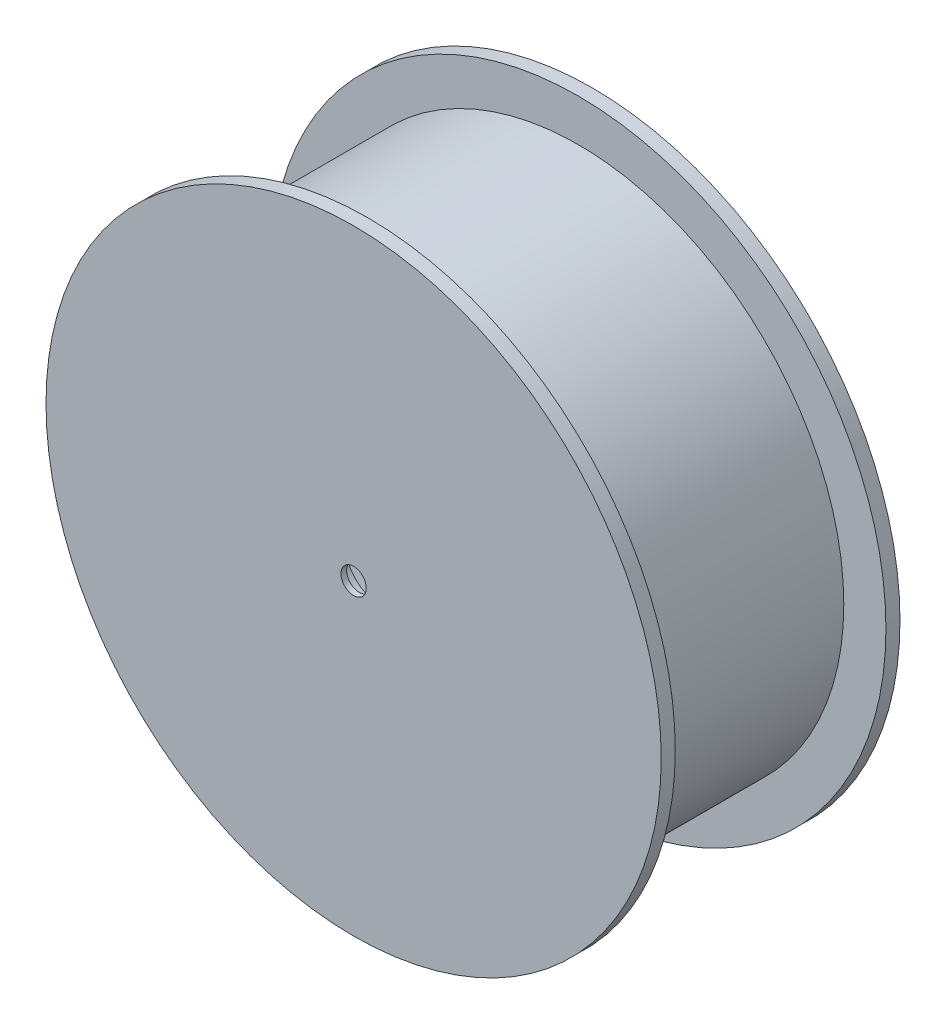
ISO-10303-21;
HEADER;
FILE_DESCRIPTION(('STEP AP214'),'2;1');
FILE_NAME('part.step','',(''),(''),'','','');
FILE_SCHEMA(('AUTOMOTIVE_DESIGN { 1 0 10303 214 1 1 1 1 }'));
ENDSEC;
DATA;
#1=APPLICATION_CONTEXT('core data for automotive mechanical design processes');
#2=APPLICATION_PROTOCOL_DEFINITION('international standard','automotive_design',2000,#1);
#3=PRODUCT_CONTEXT('',#1,'mechanical');
#4=PRODUCT('Part','Part','',(#3));
#5=PRODUCT_RELATED_PRODUCT_CATEGORY('part','',(#4));
#6=PRODUCT_DEFINITION_FORMATION('','',#4);
#7=PRODUCT_DEFINITION_CONTEXT('part definition',#1,'design');
#8=PRODUCT_DEFINITION('design','',#6,#7);
#9=PRODUCT_DEFINITION_SHAPE('','',#8);
#10=(LENGTH_UNIT() NAMED_UNIT(*) SI_UNIT(.MILLI.,.METRE.));
#11=(NAMED_UNIT(*) PLANE_ANGLE_UNIT() SI_UNIT($,.RADIAN.));
#12=(NAMED_UNIT(*) SI_UNIT($,.STERADIAN.) SOLID_ANGLE_UNIT());
#13=UNCERTAINTY_MEASURE_WITH_UNIT(LENGTH_MEASURE(1.E-05),#10,'distance_accuracy_value','');
#14=(GEOMETRIC_REPRESENTATION_CONTEXT(3) GLOBAL_UNCERTAINTY_ASSIGNED_CONTEXT((#13)) GLOBAL_UNIT_ASSIGNED_CONTEXT((#10,
#11,#12)) REPRESENTATION_CONTEXT('',''));
#15=CARTESIAN_POINT('',(0.,0.,0.));
#16=DIRECTION('',(0.,0.,1.));
#17=DIRECTION('',(1.,0.,0.));
#18=AXIS2_PLACEMENT_3D('',#15,#16,#17);
#19=CARTESIAN_POINT('',(0.,0.,-60.5882352941176));
#20=DIRECTION('',(0.,0.,1.));
#21=DIRECTION('',(1.,0.,0.));
#22=AXIS2_PLACEMENT_3D('',#19,#20,#21);
#23=CYLINDRICAL_SURFACE('',#22,4.5);
#24=CARTESIAN_POINT('',(0.,0.,24.4117647058824));
#25=DIRECTION('',(0.,0.,1.));
#26=DIRECTION('',(1.,0.,0.));
#27=AXIS2_PLACEMENT_3D('',#24,#25,#26);
#28=CIRCLE('',#27,4.5);
#29=CARTESIAN_POINT('',(4.5,0.,24.4117647058824));
#30=VERTEX_POINT('',#29);
#31=EDGE_CURVE('E215',#30,#30,#28,.T.);
#32=ORIENTED_EDGE('',*,*,#31,.T.);
#33=EDGE_LOOP('',(#32));
#34=FACE_BOUND('',#33,.T.);
#35=CARTESIAN_POINT('',(0.,0.,22.4117647058824));
#36=DIRECTION('',(0.,0.,-1.));
#37=DIRECTION('',(-1.,0.,0.));
#38=AXIS2_PLACEMENT_3D('',#35,#36,#37);
#39=CIRCLE('',#38,4.5);
#40=CARTESIAN_POINT('',(-4.5,0.,22.4117647058824));
#41=VERTEX_POINT('',#40);
#42=EDGE_CURVE('E37',#41,#41,#39,.F.);
#43=ORIENTED_EDGE('',*,*,#42,.F.);
#44=EDGE_LOOP('',(#43));
#45=FACE_BOUND('',#44,.T.);
#46=ADVANCED_FACE('F33',(#34,#45),#23,.F.);
#47=CARTESIAN_POINT('',(0.,0.,14.4117647058824));
#48=DIRECTION('',(0.,0.,-1.));
#49=DIRECTION('',(-1.,0.,0.));
#50=AXIS2_PLACEMENT_3D('',#47,#48,#49);
#51=PLANE('',#50);
#52=CARTESIAN_POINT('',(0.,0.,14.4117647058824));
#53=DIRECTION('',(0.,0.,-1.));
#54=DIRECTION('',(-1.,0.,0.));
#55=AXIS2_PLACEMENT_3D('',#52,#53,#54);
#56=CIRCLE('',#55,13.);
#57=CARTESIAN_POINT('',(-13.,0.,14.4117647058824));
#58=VERTEX_POINT('',#57);
#59=EDGE_CURVE('E208',#58,#58,#56,.T.);
#60=ORIENTED_EDGE('',*,*,#59,.F.);
#61=EDGE_LOOP('',(#60));
#62=FACE_BOUND('',#61,.T.);
#63=CARTESIAN_POINT('',(0.,0.,14.4117647058824));
#64=DIRECTION('',(0.,0.,1.));
#65=DIRECTION('',(1.,0.,0.));
#66=AXIS2_PLACEMENT_3D('',#63,#64,#65);
#67=CIRCLE('',#66,84.5);
#68=CARTESIAN_POINT('',(84.5,0.,14.4117647058824));
#69=VERTEX_POINT('',#68);
#70=EDGE_CURVE('E11',#69,#69,#67,.T.);
#71=ORIENTED_EDGE('',*,*,#70,.F.);
#72=EDGE_LOOP('',(#71));
#73=FACE_BOUND('',#72,.T.);
#74=ADVANCED_FACE('F35',(#62,#73),#51,.T.);
#75=CARTESIAN_POINT('',(0.,0.,33.8970588235295));
#76=DIRECTION('',(0.,0.,1.));
#77=DIRECTION('',(1.,0.,0.));
#78=AXIS2_PLACEMENT_3D('',#75,#76,#77);
#79=CYLINDRICAL_SURFACE('',#78,84.5);
#80=DIRECTION('',(0.,0.,-1.));
#81=VECTOR('',#80,1.);
#82=CARTESIAN_POINT('',(-78.426086848689,31.4578909274271,-57.5882352941176));
#83=LINE('',#82,#81);
#84=CARTESIAN_POINT('',(-78.426086848689,31.4578909274271,-57.5882352941176));
#85=VERTEX_POINT('',#84);
#86=CARTESIAN_POINT('',(-78.4260868486889,31.4578909274271,-60.5882352941176));
#87=VERTEX_POINT('',#86);
#88=EDGE_CURVE('E136',#85,#87,#83,.T.);
#89=ORIENTED_EDGE('',*,*,#88,.F.);
#90=CARTESIAN_POINT('',(0.,0.,-57.5882352941176));
#91=DIRECTION('',(0.,0.,1.));
#92=DIRECTION('',(-1.,0.,0.));
#93=AXIS2_PLACEMENT_3D('',#90,#91,#92);
#94=CIRCLE('',#93,84.5);
#95=CARTESIAN_POINT('',(-66.4563761169763,52.1900380666558,-57.5882352941176));
#96=VERTEX_POINT('',#95);
#97=EDGE_CURVE('E125',#96,#85,#94,.T.);
#98=ORIENTED_EDGE('',*,*,#97,.F.);
#99=DIRECTION('',(0.,0.,-1.));
#100=VECTOR('',#99,1.);
#101=CARTESIAN_POINT('',(-66.4563761169763,52.1900380666558,-57.5882352941176));
#102=LINE('',#101,#100);
#103=CARTESIAN_POINT('',(-66.4563761169763,52.1900380666558,-60.5882352941176));
#104=VERTEX_POINT('',#103);
#105=EDGE_CURVE('E138',#96,#104,#102,.T.);
#106=ORIENTED_EDGE('',*,*,#105,.T.);
#107=CARTESIAN_POINT('',(0.,0.,-60.5882352941176));
#108=DIRECTION('',(0.,0.,1.));
#109=DIRECTION('',(1.,0.,0.));
#110=AXIS2_PLACEMENT_3D('',#107,#108,#109);
#111=CIRCLE('',#110,84.5);
#112=CARTESIAN_POINT('',(-11.9697107317126,83.6479289940828,-60.5882352941176));
#113=VERTEX_POINT('',#112);
#114=EDGE_CURVE('E42',#113,#104,#111,.T.);
#115=ORIENTED_EDGE('',*,*,#114,.F.);
#116=DIRECTION('',(0.,0.,-1.));
#117=VECTOR('',#116,1.);
#118=CARTESIAN_POINT('',(-11.9697107317126,83.6479289940829,-57.5882352941176));
#119=LINE('',#118,#117);
#120=CARTESIAN_POINT('',(-11.9697107317126,83.6479289940829,-57.5882352941176));
#121=VERTEX_POINT('',#120);
#122=EDGE_CURVE('E202',#121,#113,#119,.T.);
#123=ORIENTED_EDGE('',*,*,#122,.F.);
#124=CARTESIAN_POINT('',(0.,0.,-57.5882352941176));
#125=DIRECTION('',(0.,0.,1.));
#126=DIRECTION('',(-1.,0.,0.));
#127=AXIS2_PLACEMENT_3D('',#124,#125,#126);
#128=CIRCLE('',#127,84.5);
#129=CARTESIAN_POINT('',(11.9697107317126,83.6479289940829,-57.5882352941176));
#130=VERTEX_POINT('',#129);
#131=EDGE_CURVE('E197',#130,#121,#128,.T.);
#132=ORIENTED_EDGE('',*,*,#131,.F.);
#133=DIRECTION('',(0.,0.,-1.));
#134=VECTOR('',#133,1.);
#135=CARTESIAN_POINT('',(11.9697107317126,83.6479289940829,-57.5882352941176));
#136=LINE('',#135,#134);
#137=CARTESIAN_POINT('',(11.9697107317126,83.6479289940829,-60.5882352941176));
#138=VERTEX_POINT('',#137);
#139=EDGE_CURVE('E205',#130,#138,#136,.T.);
#140=ORIENTED_EDGE('',*,*,#139,.T.);
#141=CARTESIAN_POINT('',(66.4563761169763,52.1900380666558,-60.5882352941176));
#142=VERTEX_POINT('',#141);
#143=EDGE_CURVE('E236',#142,#138,#111,.T.);
#144=ORIENTED_EDGE('',*,*,#143,.F.);
#145=DIRECTION('',(0.,0.,-1.));
#146=VECTOR('',#145,1.);
#147=CARTESIAN_POINT('',(66.4563761169764,52.1900380666558,-57.5882352941176));
#148=LINE('',#147,#146);
#149=CARTESIAN_POINT('',(66.4563761169764,52.1900380666558,-57.5882352941176));
#150=VERTEX_POINT('',#149);
#151=EDGE_CURVE('E49',#150,#142,#148,.T.);
#152=ORIENTED_EDGE('',*,*,#151,.F.);
#153=CARTESIAN_POINT('',(0.,0.,-57.5882352941176));
#154=DIRECTION('',(0.,0.,1.));
#155=DIRECTION('',(-1.,0.,0.));
#156=AXIS2_PLACEMENT_3D('',#153,#154,#155);
#157=CIRCLE('',#156,84.5);
#158=CARTESIAN_POINT('',(78.426086848689,31.4578909274271,-57.5882352941176));
#159=VERTEX_POINT('',#158);
#160=EDGE_CURVE('E186',#159,#150,#157,.T.);
#161=ORIENTED_EDGE('',*,*,#160,.F.);
#162=DIRECTION('',(0.,0.,-1.));
#163=VECTOR('',#162,1.);
#164=CARTESIAN_POINT('',(78.426086848689,31.4578909274271,-57.5882352941176));
#165=LINE('',#164,#163);
#166=CARTESIAN_POINT('',(78.426086848689,31.4578909274271,-60.5882352941176));
#167=VERTEX_POINT('',#166);
#168=EDGE_CURVE('E182',#159,#167,#165,.T.);
#169=ORIENTED_EDGE('',*,*,#168,.T.);
#170=CARTESIAN_POINT('',(78.4260868486889,-31.4578909274272,-60.5882352941176));
#171=VERTEX_POINT('',#170);
#172=EDGE_CURVE('E242',#171,#167,#111,.T.);
#173=ORIENTED_EDGE('',*,*,#172,.F.);
#174=DIRECTION('',(0.,0.,-1.));
#175=VECTOR('',#174,1.);
#176=CARTESIAN_POINT('',(78.426086848689,-31.4578909274272,-57.5882352941176));
#177=LINE('',#176,#175);
#178=CARTESIAN_POINT('',(78.426086848689,-31.4578909274272,-57.5882352941176));
#179=VERTEX_POINT('',#178);
#180=EDGE_CURVE('E57',#179,#171,#177,.T.);
#181=ORIENTED_EDGE('',*,*,#180,.F.);
#182=CARTESIAN_POINT('',(0.,0.,-57.5882352941176));
#183=DIRECTION('',(0.,0.,1.));
#184=DIRECTION('',(-1.,0.,0.));
#185=AXIS2_PLACEMENT_3D('',#182,#183,#184);
#186=CIRCLE('',#185,84.5);
#187=CARTESIAN_POINT('',(66.4563761169764,-52.1900380666558,-57.5882352941176));
#188=VERTEX_POINT('',#187);
#189=EDGE_CURVE('E175',#188,#179,#186,.T.);
#190=ORIENTED_EDGE('',*,*,#189,.F.);
#191=DIRECTION('',(0.,0.,-1.));
#192=VECTOR('',#191,1.);
#193=CARTESIAN_POINT('',(66.4563761169764,-52.1900380666558,-57.5882352941176));
#194=LINE('',#193,#192);
#195=CARTESIAN_POINT('',(66.4563761169764,-52.1900380666558,-60.5882352941176));
#196=VERTEX_POINT('',#195);
#197=EDGE_CURVE('E171',#188,#196,#194,.T.);
#198=ORIENTED_EDGE('',*,*,#197,.T.);
#199=CARTESIAN_POINT('',(11.9697107317126,-83.6479289940828,-60.5882352941176));
#200=VERTEX_POINT('',#199);
#201=EDGE_CURVE('E245',#200,#196,#111,.T.);
#202=ORIENTED_EDGE('',*,*,#201,.F.);
#203=DIRECTION('',(0.,0.,-1.));
#204=VECTOR('',#203,1.);
#205=CARTESIAN_POINT('',(11.9697107317126,-83.6479289940829,-57.5882352941176));
#206=LINE('',#205,#204);
#207=CARTESIAN_POINT('',(11.9697107317126,-83.6479289940829,-57.5882352941176));
#208=VERTEX_POINT('',#207);
#209=EDGE_CURVE('E169',#208,#200,#206,.T.);
#210=ORIENTED_EDGE('',*,*,#209,.F.);
#211=CARTESIAN_POINT('',(0.,0.,-57.5882352941176));
#212=DIRECTION('',(0.,0.,1.));
#213=DIRECTION('',(-1.,0.,0.));
#214=AXIS2_PLACEMENT_3D('',#211,#212,#213);
#215=CIRCLE('',#214,84.5);
#216=CARTESIAN_POINT('',(-11.9697107317126,-83.6479289940829,-57.5882352941176));
#217=VERTEX_POINT('',#216);
#218=EDGE_CURVE('E163',#217,#208,#215,.T.);
#219=ORIENTED_EDGE('',*,*,#218,.F.);
#220=DIRECTION('',(0.,0.,-1.));
#221=VECTOR('',#220,1.);
#222=CARTESIAN_POINT('',(-11.9697107317126,-83.6479289940829,-57.5882352941176));
#223=LINE('',#222,#221);
#224=CARTESIAN_POINT('',(-11.9697107317126,-83.6479289940829,-60.5882352941176));
#225=VERTEX_POINT('',#224);
#226=EDGE_CURVE('E159',#217,#225,#223,.T.);
#227=ORIENTED_EDGE('',*,*,#226,.T.);
#228=CARTESIAN_POINT('',(-66.4563761169763,-52.1900380666558,-60.5882352941176));
#229=VERTEX_POINT('',#228);
#230=EDGE_CURVE('E241',#229,#225,#111,.T.);
#231=ORIENTED_EDGE('',*,*,#230,.F.);
#232=DIRECTION('',(0.,0.,-1.));
#233=VECTOR('',#232,1.);
#234=CARTESIAN_POINT('',(-66.4563761169764,-52.1900380666558,-57.5882352941176));
#235=LINE('',#234,#233);
#236=CARTESIAN_POINT('',(-66.4563761169764,-52.1900380666558,-57.5882352941176));
#237=VERTEX_POINT('',#236);
#238=EDGE_CURVE('E157',#237,#229,#235,.T.);
#239=ORIENTED_EDGE('',*,*,#238,.F.);
#240=CARTESIAN_POINT('',(0.,0.,-57.5882352941176));
#241=DIRECTION('',(0.,0.,1.));
#242=DIRECTION('',(-1.,0.,0.));
#243=AXIS2_PLACEMENT_3D('',#240,#241,#242);
#244=CIRCLE('',#243,84.5);
#245=CARTESIAN_POINT('',(-78.426086848689,-31.4578909274271,-57.5882352941176));
#246=VERTEX_POINT('',#245);
#247=EDGE_CURVE('E151',#246,#237,#244,.T.);
#248=ORIENTED_EDGE('',*,*,#247,.F.);
#249=DIRECTION('',(0.,0.,-1.));
#250=VECTOR('',#249,1.);
#251=CARTESIAN_POINT('',(-78.426086848689,-31.4578909274271,-57.5882352941176));
#252=LINE('',#251,#250);
#253=CARTESIAN_POINT('',(-78.426086848689,-31.4578909274271,-60.5882352941176));
#254=VERTEX_POINT('',#253);
#255=EDGE_CURVE('E160',#246,#254,#252,.T.);
#256=ORIENTED_EDGE('',*,*,#255,.T.);
#257=EDGE_CURVE('E145',#87,#254,#111,.T.);
#258=ORIENTED_EDGE('',*,*,#257,.F.);
#259=EDGE_LOOP('',(#89,#98,#106,#115,#123,#132,#140,#144,#152,#161,#169,#173,#181,#190,#198,
#202,#210,#219,#227,#231,#239,#248,#256,#258));
#260=FACE_BOUND('',#259,.T.);
#261=ORIENTED_EDGE('',*,*,#70,.T.);
#262=EDGE_LOOP('',(#261));
#263=FACE_BOUND('',#262,.T.);
#264=ADVANCED_FACE('F141',(#260,#263),#79,.F.);
#265=CARTESIAN_POINT('',(0.,-84.5,-60.5882352941176));
#266=DIRECTION('',(0.,0.,-1.));
#267=DIRECTION('',(-1.,0.,0.));
#268=AXIS2_PLACEMENT_3D('',#265,#266,#267);
#269=PLANE('',#268);
#270=CARTESIAN_POINT('',(-73.1791466197851,42.25,-60.5882352941176));
#271=DIRECTION('',(0.,0.,-1.));
#272=DIRECTION('',(-1.,0.,0.));
#273=AXIS2_PLACEMENT_3D('',#270,#271,#272);
#274=CIRCLE('',#273,12.);
#275=EDGE_CURVE('E132',#87,#104,#274,.T.);
#276=ORIENTED_EDGE('',*,*,#275,.F.);
#277=ORIENTED_EDGE('',*,*,#257,.T.);
#278=CARTESIAN_POINT('',(-73.1791466197851,-42.25,-60.5882352941176));
#279=DIRECTION('',(0.,0.,-1.));
#280=DIRECTION('',(-1.,0.,0.));
#281=AXIS2_PLACEMENT_3D('',#278,#279,#280);
#282=CIRCLE('',#281,12.);
#283=EDGE_CURVE('E154',#229,#254,#282,.T.);
#284=ORIENTED_EDGE('',*,*,#283,.F.);
#285=ORIENTED_EDGE('',*,*,#230,.T.);
#286=CARTESIAN_POINT('',(0.,-84.5,-60.5882352941176));
#287=DIRECTION('',(0.,0.,-1.));
#288=DIRECTION('',(-1.,0.,0.));
#289=AXIS2_PLACEMENT_3D('',#286,#287,#288);
#290=CIRCLE('',#289,12.);
#291=EDGE_CURVE('E166',#200,#225,#290,.T.);
#292=ORIENTED_EDGE('',*,*,#291,.F.);
#293=ORIENTED_EDGE('',*,*,#201,.T.);
#294=CARTESIAN_POINT('',(73.179146619785,-42.2500000000001,-60.5882352941176));
#295=DIRECTION('',(0.,0.,-1.));
#296=DIRECTION('',(-1.,0.,0.));
#297=AXIS2_PLACEMENT_3D('',#294,#295,#296);
#298=CIRCLE('',#297,12.);
#299=EDGE_CURVE('E178',#171,#196,#298,.T.);
#300=ORIENTED_EDGE('',*,*,#299,.F.);
#301=ORIENTED_EDGE('',*,*,#172,.T.);
#302=CARTESIAN_POINT('',(73.1791466197851,42.25,-60.5882352941176));
#303=DIRECTION('',(0.,0.,-1.));
#304=DIRECTION('',(-1.,0.,0.));
#305=AXIS2_PLACEMENT_3D('',#302,#303,#304);
#306=CIRCLE('',#305,12.);
#307=EDGE_CURVE('E189',#142,#167,#306,.T.);
#308=ORIENTED_EDGE('',*,*,#307,.F.);
#309=ORIENTED_EDGE('',*,*,#143,.T.);
#310=CARTESIAN_POINT('',(0.,84.5,-60.5882352941176));
#311=DIRECTION('',(0.,0.,-1.));
#312=DIRECTION('',(-1.,0.,0.));
#313=AXIS2_PLACEMENT_3D('',#310,#311,#312);
#314=CIRCLE('',#313,12.);
#315=EDGE_CURVE('E147',#113,#138,#314,.T.);
#316=ORIENTED_EDGE('',*,*,#315,.F.);
#317=ORIENTED_EDGE('',*,*,#114,.T.);
#318=EDGE_LOOP('',(#276,#277,#284,#285,#292,#293,#300,#301,#308,#309,#316,#317));
#319=FACE_BOUND('',#318,.T.);
#320=CARTESIAN_POINT('',(0.,0.,-60.5882352941176));
#321=DIRECTION('',(0.,0.,1.));
#322=DIRECTION('',(1.,0.,0.));
#323=AXIS2_PLACEMENT_3D('',#320,#321,#322);
#324=CIRCLE('',#323,109.5);
#325=CARTESIAN_POINT('',(109.5,0.,-60.5882352941176));
#326=VERTEX_POINT('',#325);
#327=EDGE_CURVE('E233',#326,#326,#324,.T.);
#328=ORIENTED_EDGE('',*,*,#327,.F.);
#329=EDGE_LOOP('',(#328));
#330=FACE_BOUND('',#329,.T.);
#331=ADVANCED_FACE('F253',(#319,#330),#269,.T.);
#332=CARTESIAN_POINT('',(0.,0.,33.8970588235295));
#333=DIRECTION('',(0.,0.,1.));
#334=DIRECTION('',(1.,0.,0.));
#335=AXIS2_PLACEMENT_3D('',#332,#333,#334);
#336=CYLINDRICAL_SURFACE('',#335,109.5);
#337=ORIENTED_EDGE('',*,*,#327,.T.);
#338=EDGE_LOOP('',(#337));
#339=FACE_BOUND('',#338,.T.);
#340=CARTESIAN_POINT('',(0.,0.,-55.5882352941176));
#341=DIRECTION('',(0.,0.,1.));
#342=DIRECTION('',(1.,0.,0.));
#343=AXIS2_PLACEMENT_3D('',#340,#341,#342);
#344=CIRCLE('',#343,109.5);
#345=CARTESIAN_POINT('',(109.5,0.,-55.5882352941176));
#346=VERTEX_POINT('',#345);
#347=EDGE_CURVE('E230',#346,#346,#344,.T.);
#348=ORIENTED_EDGE('',*,*,#347,.F.);
#349=EDGE_LOOP('',(#348));
#350=FACE_BOUND('',#349,.T.);
#351=ADVANCED_FACE('F310',(#339,#350),#336,.T.);
#352=CARTESIAN_POINT('',(0.,-94.5,-55.5882352941176));
#353=DIRECTION('',(0.,0.,1.));
#354=DIRECTION('',(1.,0.,0.));
#355=AXIS2_PLACEMENT_3D('',#352,#353,#354);
#356=PLANE('',#355);
#357=ORIENTED_EDGE('',*,*,#347,.T.);
#358=EDGE_LOOP('',(#357));
#359=FACE_BOUND('',#358,.T.);
#360=CARTESIAN_POINT('',(0.,0.,-55.5882352941176));
#361=DIRECTION('',(0.,0.,1.));
#362=DIRECTION('',(1.,0.,0.));
#363=AXIS2_PLACEMENT_3D('',#360,#361,#362);
#364=CIRCLE('',#363,94.5);
#365=CARTESIAN_POINT('',(94.5,0.,-55.5882352941176));
#366=VERTEX_POINT('',#365);
#367=EDGE_CURVE('E227',#366,#366,#364,.T.);
#368=ORIENTED_EDGE('',*,*,#367,.F.);
#369=EDGE_LOOP('',(#368));
#370=FACE_BOUND('',#369,.T.);
#371=ADVANCED_FACE('F306',(#359,#370),#356,.T.);
#372=CARTESIAN_POINT('',(0.,0.,33.8970588235295));
#373=DIRECTION('',(0.,0.,1.));
#374=DIRECTION('',(1.,0.,0.));
#375=AXIS2_PLACEMENT_3D('',#372,#373,#374);
#376=CYLINDRICAL_SURFACE('',#375,94.5);
#377=ORIENTED_EDGE('',*,*,#367,.T.);
#378=EDGE_LOOP('',(#377));
#379=FACE_BOUND('',#378,.T.);
#380=CARTESIAN_POINT('',(0.,0.,19.4117647058824));
#381=DIRECTION('',(0.,0.,1.));
#382=DIRECTION('',(1.,0.,0.));
#383=AXIS2_PLACEMENT_3D('',#380,#381,#382);
#384=CIRCLE('',#383,94.5);
#385=CARTESIAN_POINT('',(94.5,0.,19.4117647058824));
#386=VERTEX_POINT('',#385);
#387=EDGE_CURVE('E224',#386,#386,#384,.T.);
#388=ORIENTED_EDGE('',*,*,#387,.F.);
#389=EDGE_LOOP('',(#388));
#390=FACE_BOUND('',#389,.T.);
#391=ADVANCED_FACE('F302',(#379,#390),#376,.T.);
#392=CARTESIAN_POINT('',(0.,-109.5,19.4117647058824));
#393=DIRECTION('',(0.,0.,-1.));
#394=DIRECTION('',(-1.,0.,0.));
#395=AXIS2_PLACEMENT_3D('',#392,#393,#394);
#396=PLANE('',#395);
#397=ORIENTED_EDGE('',*,*,#387,.T.);
#398=EDGE_LOOP('',(#397));
#399=FACE_BOUND('',#398,.T.);
#400=CARTESIAN_POINT('',(0.,0.,19.4117647058824));
#401=DIRECTION('',(0.,0.,1.));
#402=DIRECTION('',(1.,0.,0.));
#403=AXIS2_PLACEMENT_3D('',#400,#401,#402);
#404=CIRCLE('',#403,109.5);
#405=CARTESIAN_POINT('',(109.5,0.,19.4117647058824));
#406=VERTEX_POINT('',#405);
#407=EDGE_CURVE('E221',#406,#406,#404,.T.);
#408=ORIENTED_EDGE('',*,*,#407,.F.);
#409=EDGE_LOOP('',(#408));
#410=FACE_BOUND('',#409,.T.);
#411=ADVANCED_FACE('F298',(#399,#410),#396,.T.);
#412=CARTESIAN_POINT('',(0.,0.,33.8970588235295));
#413=DIRECTION('',(0.,0.,1.));
#414=DIRECTION('',(1.,0.,0.));
#415=AXIS2_PLACEMENT_3D('',#412,#413,#414);
#416=CYLINDRICAL_SURFACE('',#415,109.5);
#417=ORIENTED_EDGE('',*,*,#407,.T.);
#418=EDGE_LOOP('',(#417));
#419=FACE_BOUND('',#418,.T.);
#420=CARTESIAN_POINT('',(0.,0.,24.4117647058824));
#421=DIRECTION('',(0.,0.,1.));
#422=DIRECTION('',(1.,0.,0.));
#423=AXIS2_PLACEMENT_3D('',#420,#421,#422);
#424=CIRCLE('',#423,109.5);
#425=CARTESIAN_POINT('',(109.5,0.,24.4117647058824));
#426=VERTEX_POINT('',#425);
#427=EDGE_CURVE('E218',#426,#426,#424,.T.);
#428=ORIENTED_EDGE('',*,*,#427,.F.);
#429=EDGE_LOOP('',(#428));
#430=FACE_BOUND('',#429,.T.);
#431=ADVANCED_FACE('F294',(#419,#430),#416,.T.);
#432=CARTESIAN_POINT('',(0.,0.,24.4117647058824));
#433=DIRECTION('',(0.,0.,1.));
#434=DIRECTION('',(1.,0.,0.));
#435=AXIS2_PLACEMENT_3D('',#432,#433,#434);
#436=PLANE('',#435);
#437=ORIENTED_EDGE('',*,*,#31,.F.);
#438=EDGE_LOOP('',(#437));
#439=FACE_BOUND('',#438,.T.);
#440=ORIENTED_EDGE('',*,*,#427,.T.);
#441=EDGE_LOOP('',(#440));
#442=FACE_BOUND('',#441,.T.);
#443=ADVANCED_FACE('F290',(#439,#442),#436,.T.);
#444=CARTESIAN_POINT('',(0.,0.,22.4117647058824));
#445=DIRECTION('',(0.,0.,-1.));
#446=DIRECTION('',(-1.,0.,0.));
#447=AXIS2_PLACEMENT_3D('',#444,#445,#446);
#448=PLANE('',#447);
#449=CARTESIAN_POINT('',(0.,0.,22.4117647058824));
#450=DIRECTION('',(0.,0.,-1.));
#451=DIRECTION('',(-1.,0.,0.));
#452=AXIS2_PLACEMENT_3D('',#449,#450,#451);
#453=CIRCLE('',#452,13.);
#454=CARTESIAN_POINT('',(-13.,0.,22.4117647058824));
#455=VERTEX_POINT('',#454);
#456=EDGE_CURVE('E210',#455,#455,#453,.T.);
#457=ORIENTED_EDGE('',*,*,#456,.T.);
#458=EDGE_LOOP('',(#457));
#459=FACE_BOUND('',#458,.T.);
#460=ORIENTED_EDGE('',*,*,#42,.T.);
#461=EDGE_LOOP('',(#460));
#462=FACE_BOUND('',#461,.T.);
#463=ADVANCED_FACE('F293',(#459,#462),#448,.T.);
#464=CARTESIAN_POINT('',(0.,0.,22.4117647058824));
#465=DIRECTION('',(0.,0.,-1.));
#466=DIRECTION('',(-1.,0.,0.));
#467=AXIS2_PLACEMENT_3D('',#464,#465,#466);
#468=CYLINDRICAL_SURFACE('',#467,13.);
#469=ORIENTED_EDGE('',*,*,#456,.F.);
#470=EDGE_LOOP('',(#469));
#471=FACE_BOUND('',#470,.T.);
#472=ORIENTED_EDGE('',*,*,#59,.T.);
#473=EDGE_LOOP('',(#472));
#474=FACE_BOUND('',#473,.T.);
#475=ADVANCED_FACE('F288',(#471,#474),#468,.F.);
#476=CARTESIAN_POINT('',(0.,84.5,-57.5882352941176));
#477=DIRECTION('',(0.,0.,-1.));
#478=DIRECTION('',(-1.,0.,0.));
#479=AXIS2_PLACEMENT_3D('',#476,#477,#478);
#480=CYLINDRICAL_SURFACE('',#479,12.);
#481=ORIENTED_EDGE('',*,*,#315,.T.);
#482=ORIENTED_EDGE('',*,*,#139,.F.);
#483=CARTESIAN_POINT('',(0.,84.5,-57.5882352941176));
#484=DIRECTION('',(0.,0.,-1.));
#485=DIRECTION('',(-1.,0.,0.));
#486=AXIS2_PLACEMENT_3D('',#483,#484,#485);
#487=CIRCLE('',#486,12.);
#488=EDGE_CURVE('E199',#121,#130,#487,.T.);
#489=ORIENTED_EDGE('',*,*,#488,.F.);
#490=ORIENTED_EDGE('',*,*,#122,.T.);
#491=EDGE_LOOP('',(#481,#482,#489,#490));
#492=FACE_BOUND('',#491,.T.);
#493=ADVANCED_FACE('F362',(#492),#480,.F.);
#494=CARTESIAN_POINT('',(0.,42.25,-57.5882352941176));
#495=DIRECTION('',(0.,0.,-1.));
#496=DIRECTION('',(-1.,0.,0.));
#497=AXIS2_PLACEMENT_3D('',#494,#495,#496);
#498=PLANE('',#497);
#499=CARTESIAN_POINT('',(0.,90.5000000000001,-57.5882352941176));
#500=DIRECTION('',(0.,0.,-1.));
#501=DIRECTION('',(-1.,0.,0.));
#502=AXIS2_PLACEMENT_3D('',#499,#500,#501);
#503=CIRCLE('',#502,1.);
#504=CARTESIAN_POINT('',(-1.,90.5000000000001,-57.5882352941176));
#505=VERTEX_POINT('',#504);
#506=EDGE_CURVE('E571',#505,#505,#503,.T.);
#507=ORIENTED_EDGE('',*,*,#506,.F.);
#508=EDGE_LOOP('',(#507));
#509=FACE_BOUND('',#508,.T.);
#510=ORIENTED_EDGE('',*,*,#131,.T.);
#511=ORIENTED_EDGE('',*,*,#488,.T.);
#512=EDGE_LOOP('',(#510,#511));
#513=FACE_BOUND('',#512,.T.);
#514=ADVANCED_FACE('F368',(#509,#513),#498,.T.);
#515=CARTESIAN_POINT('',(73.1791466197851,42.25,-57.5882352941176));
#516=DIRECTION('',(0.,0.,-1.));
#517=DIRECTION('',(-1.,0.,0.));
#518=AXIS2_PLACEMENT_3D('',#515,#516,#517);
#519=CYLINDRICAL_SURFACE('',#518,12.);
#520=ORIENTED_EDGE('',*,*,#307,.T.);
#521=ORIENTED_EDGE('',*,*,#168,.F.);
#522=CARTESIAN_POINT('',(73.1791466197851,42.25,-57.5882352941176));
#523=DIRECTION('',(0.,0.,-1.));
#524=DIRECTION('',(-1.,0.,0.));
#525=AXIS2_PLACEMENT_3D('',#522,#523,#524);
#526=CIRCLE('',#525,12.);
#527=EDGE_CURVE('E188',#150,#159,#526,.T.);
#528=ORIENTED_EDGE('',*,*,#527,.F.);
#529=ORIENTED_EDGE('',*,*,#151,.T.);
#530=EDGE_LOOP('',(#520,#521,#528,#529));
#531=FACE_BOUND('',#530,.T.);
#532=ADVANCED_FACE('F377',(#531),#519,.F.);
#533=CARTESIAN_POINT('',(36.5895733098925,21.125,-57.5882352941176));
#534=DIRECTION('',(0.,0.,-1.));
#535=DIRECTION('',(-1.,0.,0.));
#536=AXIS2_PLACEMENT_3D('',#533,#534,#535);
#537=PLANE('',#536);
#538=CARTESIAN_POINT('',(78.3752990424918,45.25,-57.5882352941176));
#539=DIRECTION('',(0.,0.,-1.));
#540=DIRECTION('',(-1.,0.,0.));
#541=AXIS2_PLACEMENT_3D('',#538,#539,#540);
#542=CIRCLE('',#541,0.999999999999998);
#543=CARTESIAN_POINT('',(77.3752990424918,45.25,-57.5882352941176));
#544=VERTEX_POINT('',#543);
#545=EDGE_CURVE('E577',#544,#544,#542,.T.);
#546=ORIENTED_EDGE('',*,*,#545,.F.);
#547=EDGE_LOOP('',(#546));
#548=FACE_BOUND('',#547,.T.);
#549=ORIENTED_EDGE('',*,*,#160,.T.);
#550=ORIENTED_EDGE('',*,*,#527,.T.);
#551=EDGE_LOOP('',(#549,#550));
#552=FACE_BOUND('',#551,.T.);
#553=ADVANCED_FACE('F386',(#548,#552),#537,.T.);
#554=CARTESIAN_POINT('',(73.179146619785,-42.2500000000001,-57.5882352941176));
#555=DIRECTION('',(0.,0.,-1.));
#556=DIRECTION('',(-1.,0.,0.));
#557=AXIS2_PLACEMENT_3D('',#554,#555,#556);
#558=CYLINDRICAL_SURFACE('',#557,12.);
#559=ORIENTED_EDGE('',*,*,#299,.T.);
#560=ORIENTED_EDGE('',*,*,#197,.F.);
#561=CARTESIAN_POINT('',(73.179146619785,-42.2500000000001,-57.5882352941176));
#562=DIRECTION('',(0.,0.,-1.));
#563=DIRECTION('',(-1.,0.,0.));
#564=AXIS2_PLACEMENT_3D('',#561,#562,#563);
#565=CIRCLE('',#564,12.);
#566=EDGE_CURVE('E177',#179,#188,#565,.T.);
#567=ORIENTED_EDGE('',*,*,#566,.F.);
#568=ORIENTED_EDGE('',*,*,#180,.T.);
#569=EDGE_LOOP('',(#559,#560,#567,#568));
#570=FACE_BOUND('',#569,.T.);
#571=ADVANCED_FACE('F393',(#570),#558,.F.);
#572=CARTESIAN_POINT('',(36.5895733098925,-21.125,-57.5882352941176));
#573=DIRECTION('',(0.,0.,-1.));
#574=DIRECTION('',(-1.,0.,0.));
#575=AXIS2_PLACEMENT_3D('',#572,#573,#574);
#576=PLANE('',#575);
#577=CARTESIAN_POINT('',(78.3752990424917,-45.2500000000001,-57.5882352941176));
#578=DIRECTION('',(0.,0.,-1.));
#579=DIRECTION('',(-1.,0.,0.));
#580=AXIS2_PLACEMENT_3D('',#577,#578,#579);
#581=CIRCLE('',#580,0.999999999999998);
#582=CARTESIAN_POINT('',(77.3752990424917,-45.2500000000001,-57.5882352941176));
#583=VERTEX_POINT('',#582);
#584=EDGE_CURVE('E582',#583,#583,#581,.T.);
#585=ORIENTED_EDGE('',*,*,#584,.F.);
#586=EDGE_LOOP('',(#585));
#587=FACE_BOUND('',#586,.T.);
#588=ORIENTED_EDGE('',*,*,#189,.T.);
#589=ORIENTED_EDGE('',*,*,#566,.T.);
#590=EDGE_LOOP('',(#588,#589));
#591=FACE_BOUND('',#590,.T.);
#592=ADVANCED_FACE('F275',(#587,#591),#576,.T.);
#593=CARTESIAN_POINT('',(0.,-84.5,-57.5882352941176));
#594=DIRECTION('',(0.,0.,-1.));
#595=DIRECTION('',(-1.,0.,0.));
#596=AXIS2_PLACEMENT_3D('',#593,#594,#595);
#597=CYLINDRICAL_SURFACE('',#596,12.);
#598=ORIENTED_EDGE('',*,*,#291,.T.);
#599=ORIENTED_EDGE('',*,*,#226,.F.);
#600=CARTESIAN_POINT('',(0.,-84.5,-57.5882352941176));
#601=DIRECTION('',(0.,0.,-1.));
#602=DIRECTION('',(-1.,0.,0.));
#603=AXIS2_PLACEMENT_3D('',#600,#601,#602);
#604=CIRCLE('',#603,12.);
#605=EDGE_CURVE('E165',#208,#217,#604,.T.);
#606=ORIENTED_EDGE('',*,*,#605,.F.);
#607=ORIENTED_EDGE('',*,*,#209,.T.);
#608=EDGE_LOOP('',(#598,#599,#606,#607));
#609=FACE_BOUND('',#608,.T.);
#610=ADVANCED_FACE('F261',(#609),#597,.F.);
#611=CARTESIAN_POINT('',(0.,-42.25,-57.5882352941176));
#612=DIRECTION('',(0.,0.,-1.));
#613=DIRECTION('',(-1.,0.,0.));
#614=AXIS2_PLACEMENT_3D('',#611,#612,#613);
#615=PLANE('',#614);
#616=CARTESIAN_POINT('',(0.,-90.5000000000001,-57.5882352941176));
#617=DIRECTION('',(0.,0.,-1.));
#618=DIRECTION('',(-1.,0.,0.));
#619=AXIS2_PLACEMENT_3D('',#616,#617,#618);
#620=CIRCLE('',#619,1.);
#621=CARTESIAN_POINT('',(-1.00000000000001,-90.5000000000001,-57.5882352941176));
#622=VERTEX_POINT('',#621);
#623=EDGE_CURVE('E588',#622,#622,#620,.T.);
#624=ORIENTED_EDGE('',*,*,#623,.F.);
#625=EDGE_LOOP('',(#624));
#626=FACE_BOUND('',#625,.T.);
#627=ORIENTED_EDGE('',*,*,#218,.T.);
#628=ORIENTED_EDGE('',*,*,#605,.T.);
#629=EDGE_LOOP('',(#627,#628));
#630=FACE_BOUND('',#629,.T.);
#631=ADVANCED_FACE('F263',(#626,#630),#615,.T.);
#632=CARTESIAN_POINT('',(-73.1791466197851,-42.25,-57.5882352941176));
#633=DIRECTION('',(0.,0.,-1.));
#634=DIRECTION('',(-1.,0.,0.));
#635=AXIS2_PLACEMENT_3D('',#632,#633,#634);
#636=CYLINDRICAL_SURFACE('',#635,12.);
#637=ORIENTED_EDGE('',*,*,#283,.T.);
#638=ORIENTED_EDGE('',*,*,#255,.F.);
#639=CARTESIAN_POINT('',(-73.1791466197851,-42.25,-57.5882352941176));
#640=DIRECTION('',(0.,0.,-1.));
#641=DIRECTION('',(-1.,0.,0.));
#642=AXIS2_PLACEMENT_3D('',#639,#640,#641);
#643=CIRCLE('',#642,12.);
#644=EDGE_CURVE('E153',#237,#246,#643,.T.);
#645=ORIENTED_EDGE('',*,*,#644,.F.);
#646=ORIENTED_EDGE('',*,*,#238,.T.);
#647=EDGE_LOOP('',(#637,#638,#645,#646));
#648=FACE_BOUND('',#647,.T.);
#649=ADVANCED_FACE('F265',(#648),#636,.F.);
#650=CARTESIAN_POINT('',(-36.5895733098925,-21.125,-57.5882352941176));
#651=DIRECTION('',(0.,0.,-1.));
#652=DIRECTION('',(-1.,0.,0.));
#653=AXIS2_PLACEMENT_3D('',#650,#651,#652);
#654=PLANE('',#653);
#655=CARTESIAN_POINT('',(-78.3752990424918,-45.25,-57.5882352941176));
#656=DIRECTION('',(0.,0.,-1.));
#657=DIRECTION('',(-1.,0.,0.));
#658=AXIS2_PLACEMENT_3D('',#655,#656,#657);
#659=CIRCLE('',#658,0.999999999999998);
#660=CARTESIAN_POINT('',(-79.3752990424918,-45.25,-57.5882352941176));
#661=VERTEX_POINT('',#660);
#662=EDGE_CURVE('E568',#661,#661,#659,.T.);
#663=ORIENTED_EDGE('',*,*,#662,.F.);
#664=EDGE_LOOP('',(#663));
#665=FACE_BOUND('',#664,.T.);
#666=ORIENTED_EDGE('',*,*,#247,.T.);
#667=ORIENTED_EDGE('',*,*,#644,.T.);
#668=EDGE_LOOP('',(#666,#667));
#669=FACE_BOUND('',#668,.T.);
#670=ADVANCED_FACE('F272',(#665,#669),#654,.T.);
#671=CARTESIAN_POINT('',(-73.1791466197851,42.25,-57.5882352941176));
#672=DIRECTION('',(0.,0.,-1.));
#673=DIRECTION('',(-1.,0.,0.));
#674=AXIS2_PLACEMENT_3D('',#671,#672,#673);
#675=CYLINDRICAL_SURFACE('',#674,12.);
#676=ORIENTED_EDGE('',*,*,#275,.T.);
#677=ORIENTED_EDGE('',*,*,#105,.F.);
#678=CARTESIAN_POINT('',(-73.1791466197851,42.25,-57.5882352941176));
#679=DIRECTION('',(0.,0.,-1.));
#680=DIRECTION('',(-1.,0.,0.));
#681=AXIS2_PLACEMENT_3D('',#678,#679,#680);
#682=CIRCLE('',#681,12.);
#683=EDGE_CURVE('E128',#85,#96,#682,.T.);
#684=ORIENTED_EDGE('',*,*,#683,.F.);
#685=ORIENTED_EDGE('',*,*,#88,.T.);
#686=EDGE_LOOP('',(#676,#677,#684,#685));
#687=FACE_BOUND('',#686,.T.);
#688=ADVANCED_FACE('F135',(#687),#675,.F.);
#689=CARTESIAN_POINT('',(-36.5895733098925,21.125,-57.5882352941176));
#690=DIRECTION('',(0.,0.,-1.));
#691=DIRECTION('',(-1.,0.,0.));
#692=AXIS2_PLACEMENT_3D('',#689,#690,#691);
#693=PLANE('',#692);
#694=CARTESIAN_POINT('',(-78.3752990424917,45.25,-57.5882352941176));
#695=DIRECTION('',(0.,0.,-1.));
#696=DIRECTION('',(-1.,0.,0.));
#697=AXIS2_PLACEMENT_3D('',#694,#695,#696);
#698=CIRCLE('',#697,0.999999999999998);
#699=CARTESIAN_POINT('',(-79.3752990424917,45.25,-57.5882352941176));
#700=VERTEX_POINT('',#699);
#701=EDGE_CURVE('E598',#700,#700,#698,.T.);
#702=ORIENTED_EDGE('',*,*,#701,.F.);
#703=EDGE_LOOP('',(#702));
#704=FACE_BOUND('',#703,.T.);
#705=ORIENTED_EDGE('',*,*,#97,.T.);
#706=ORIENTED_EDGE('',*,*,#683,.T.);
#707=EDGE_LOOP('',(#705,#706));
#708=FACE_BOUND('',#707,.T.);
#709=ADVANCED_FACE('F127',(#704,#708),#693,.T.);
#710=CARTESIAN_POINT('',(0.,90.5000000000001,-52.5882352941176));
#711=DIRECTION('',(0.,0.,-1.));
#712=DIRECTION('',(-1.,0.,0.));
#713=AXIS2_PLACEMENT_3D('',#710,#711,#712);
#714=CYLINDRICAL_SURFACE('',#713,1.);
#715=CARTESIAN_POINT('',(0.,90.5000000000001,-52.5882352941176));
#716=DIRECTION('',(0.,0.,-1.));
#717=DIRECTION('',(-1.,0.,0.));
#718=AXIS2_PLACEMENT_3D('',#715,#716,#717);
#719=CIRCLE('',#718,1.);
#720=CARTESIAN_POINT('',(-1.,90.5000000000001,-52.5882352941176));
#721=VERTEX_POINT('',#720);
#722=EDGE_CURVE('E193',#721,#721,#719,.T.);
#723=ORIENTED_EDGE('',*,*,#722,.F.);
#724=EDGE_LOOP('',(#723));
#725=FACE_BOUND('',#724,.T.);
#726=ORIENTED_EDGE('',*,*,#506,.T.);
#727=EDGE_LOOP('',(#726));
#728=FACE_BOUND('',#727,.T.);
#729=ADVANCED_FACE('F438',(#725,#728),#714,.F.);
#730=CARTESIAN_POINT('',(0.,90.5000000000001,-52.5882352941176));
#731=DIRECTION('',(0.,0.,-1.));
#732=DIRECTION('',(-1.,0.,0.));
#733=AXIS2_PLACEMENT_3D('',#730,#731,#732);
#734=PLANE('',#733);
#735=ORIENTED_EDGE('',*,*,#722,.T.);
#736=EDGE_LOOP('',(#735));
#737=FACE_BOUND('',#736,.T.);
#738=ADVANCED_FACE('F445',(#737),#734,.T.);
#739=CARTESIAN_POINT('',(-78.3752990424917,45.25,-52.5882352941176));
#740=DIRECTION('',(0.,0.,-1.));
#741=DIRECTION('',(-1.,0.,0.));
#742=AXIS2_PLACEMENT_3D('',#739,#740,#741);
#743=CYLINDRICAL_SURFACE('',#742,0.999999999999998);
#744=CARTESIAN_POINT('',(-78.3752990424917,45.25,-52.5882352941176));
#745=DIRECTION('',(0.,0.,-1.));
#746=DIRECTION('',(-1.,0.,0.));
#747=AXIS2_PLACEMENT_3D('',#744,#745,#746);
#748=CIRCLE('',#747,0.999999999999998);
#749=CARTESIAN_POINT('',(-79.3752990424917,45.25,-52.5882352941176));
#750=VERTEX_POINT('',#749);
#751=EDGE_CURVE('E574',#750,#750,#748,.T.);
#752=ORIENTED_EDGE('',*,*,#751,.F.);
#753=EDGE_LOOP('',(#752));
#754=FACE_BOUND('',#753,.T.);
#755=ORIENTED_EDGE('',*,*,#701,.T.);
#756=EDGE_LOOP('',(#755));
#757=FACE_BOUND('',#756,.T.);
#758=ADVANCED_FACE('F453',(#754,#757),#743,.F.);
#759=CARTESIAN_POINT('',(-78.3752990424917,45.25,-52.5882352941176));
#760=DIRECTION('',(0.,0.,-1.));
#761=DIRECTION('',(-1.,0.,0.));
#762=AXIS2_PLACEMENT_3D('',#759,#760,#761);
#763=PLANE('',#762);
#764=ORIENTED_EDGE('',*,*,#751,.T.);
#765=EDGE_LOOP('',(#764));
#766=FACE_BOUND('',#765,.T.);
#767=ADVANCED_FACE('F461',(#766),#763,.T.);
#768=CARTESIAN_POINT('',(-78.3752990424918,-45.25,-52.5882352941176));
#769=DIRECTION('',(0.,0.,-1.));
#770=DIRECTION('',(-1.,0.,0.));
#771=AXIS2_PLACEMENT_3D('',#768,#769,#770);
#772=CYLINDRICAL_SURFACE('',#771,0.999999999999998);
#773=CARTESIAN_POINT('',(-78.3752990424918,-45.25,-52.5882352941176));
#774=DIRECTION('',(0.,0.,-1.));
#775=DIRECTION('',(-1.,0.,0.));
#776=AXIS2_PLACEMENT_3D('',#773,#774,#775);
#777=CIRCLE('',#776,0.999999999999998);
#778=CARTESIAN_POINT('',(-79.3752990424918,-45.25,-52.5882352941176));
#779=VERTEX_POINT('',#778);
#780=EDGE_CURVE('E595',#779,#779,#777,.T.);
#781=ORIENTED_EDGE('',*,*,#780,.F.);
#782=EDGE_LOOP('',(#781));
#783=FACE_BOUND('',#782,.T.);
#784=ORIENTED_EDGE('',*,*,#662,.T.);
#785=EDGE_LOOP('',(#784));
#786=FACE_BOUND('',#785,.T.);
#787=ADVANCED_FACE('F469',(#783,#786),#772,.F.);
#788=CARTESIAN_POINT('',(-78.3752990424918,-45.25,-52.5882352941176));
#789=DIRECTION('',(0.,0.,-1.));
#790=DIRECTION('',(-1.,0.,0.));
#791=AXIS2_PLACEMENT_3D('',#788,#789,#790);
#792=PLANE('',#791);
#793=ORIENTED_EDGE('',*,*,#780,.T.);
#794=EDGE_LOOP('',(#793));
#795=FACE_BOUND('',#794,.T.);
#796=ADVANCED_FACE('F477',(#795),#792,.T.);
#797=CARTESIAN_POINT('',(0.,-90.5000000000001,-52.5882352941176));
#798=DIRECTION('',(0.,0.,-1.));
#799=DIRECTION('',(-1.,0.,0.));
#800=AXIS2_PLACEMENT_3D('',#797,#798,#799);
#801=CYLINDRICAL_SURFACE('',#800,1.);
#802=CARTESIAN_POINT('',(0.,-90.5000000000001,-52.5882352941176));
#803=DIRECTION('',(0.,0.,-1.));
#804=DIRECTION('',(-1.,0.,0.));
#805=AXIS2_PLACEMENT_3D('',#802,#803,#804);
#806=CIRCLE('',#805,1.);
#807=CARTESIAN_POINT('',(-1.00000000000001,-90.5000000000001,-52.5882352941176));
#808=VERTEX_POINT('',#807);
#809=EDGE_CURVE('E591',#808,#808,#806,.T.);
#810=ORIENTED_EDGE('',*,*,#809,.F.);
#811=EDGE_LOOP('',(#810));
#812=FACE_BOUND('',#811,.T.);
#813=ORIENTED_EDGE('',*,*,#623,.T.);
#814=EDGE_LOOP('',(#813));
#815=FACE_BOUND('',#814,.T.);
#816=ADVANCED_FACE('F485',(#812,#815),#801,.F.);
#817=CARTESIAN_POINT('',(0.,-90.5000000000001,-52.5882352941176));
#818=DIRECTION('',(0.,0.,-1.));
#819=DIRECTION('',(-1.,0.,0.));
#820=AXIS2_PLACEMENT_3D('',#817,#818,#819);
#821=PLANE('',#820);
#822=ORIENTED_EDGE('',*,*,#809,.T.);
#823=EDGE_LOOP('',(#822));
#824=FACE_BOUND('',#823,.T.);
#825=ADVANCED_FACE('F493',(#824),#821,.T.);
#826=CARTESIAN_POINT('',(78.3752990424917,-45.2500000000001,-52.5882352941176));
#827=DIRECTION('',(0.,0.,-1.));
#828=DIRECTION('',(-1.,0.,0.));
#829=AXIS2_PLACEMENT_3D('',#826,#827,#828);
#830=CYLINDRICAL_SURFACE('',#829,0.999999999999998);
#831=CARTESIAN_POINT('',(78.3752990424917,-45.2500000000001,-52.5882352941176));
#832=DIRECTION('',(0.,0.,-1.));
#833=DIRECTION('',(-1.,0.,0.));
#834=AXIS2_PLACEMENT_3D('',#831,#832,#833);
#835=CIRCLE('',#834,0.999999999999998);
#836=CARTESIAN_POINT('',(77.3752990424917,-45.2500000000001,-52.5882352941176));
#837=VERTEX_POINT('',#836);
#838=EDGE_CURVE('E585',#837,#837,#835,.T.);
#839=ORIENTED_EDGE('',*,*,#838,.F.);
#840=EDGE_LOOP('',(#839));
#841=FACE_BOUND('',#840,.T.);
#842=ORIENTED_EDGE('',*,*,#584,.T.);
#843=EDGE_LOOP('',(#842));
#844=FACE_BOUND('',#843,.T.);
#845=ADVANCED_FACE('F501',(#841,#844),#830,.F.);
#846=CARTESIAN_POINT('',(78.3752990424917,-45.2500000000001,-52.5882352941176));
#847=DIRECTION('',(0.,0.,-1.));
#848=DIRECTION('',(-1.,0.,0.));
#849=AXIS2_PLACEMENT_3D('',#846,#847,#848);
#850=PLANE('',#849);
#851=ORIENTED_EDGE('',*,*,#838,.T.);
#852=EDGE_LOOP('',(#851));
#853=FACE_BOUND('',#852,.T.);
#854=ADVANCED_FACE('F509',(#853),#850,.T.);
#855=CARTESIAN_POINT('',(78.3752990424918,45.25,-52.5882352941176));
#856=DIRECTION('',(0.,0.,-1.));
#857=DIRECTION('',(-1.,0.,0.));
#858=AXIS2_PLACEMENT_3D('',#855,#856,#857);
#859=CYLINDRICAL_SURFACE('',#858,0.999999999999998);
#860=CARTESIAN_POINT('',(78.3752990424918,45.25,-52.5882352941176));
#861=DIRECTION('',(0.,0.,-1.));
#862=DIRECTION('',(-1.,0.,0.));
#863=AXIS2_PLACEMENT_3D('',#860,#861,#862);
#864=CIRCLE('',#863,0.999999999999998);
#865=CARTESIAN_POINT('',(77.3752990424918,45.25,-52.5882352941176));
#866=VERTEX_POINT('',#865);
#867=EDGE_CURVE('E580',#866,#866,#864,.T.);
#868=ORIENTED_EDGE('',*,*,#867,.F.);
#869=EDGE_LOOP('',(#868));
#870=FACE_BOUND('',#869,.T.);
#871=ORIENTED_EDGE('',*,*,#545,.T.);
#872=EDGE_LOOP('',(#871));
#873=FACE_BOUND('',#872,.T.);
#874=ADVANCED_FACE('F517',(#870,#873),#859,.F.);
#875=CARTESIAN_POINT('',(78.3752990424918,45.25,-52.5882352941176));
#876=DIRECTION('',(0.,0.,-1.));
#877=DIRECTION('',(-1.,0.,0.));
#878=AXIS2_PLACEMENT_3D('',#875,#876,#877);
#879=PLANE('',#878);
#880=ORIENTED_EDGE('',*,*,#867,.T.);
#881=EDGE_LOOP('',(#880));
#882=FACE_BOUND('',#881,.T.);
#883=ADVANCED_FACE('F525',(#882),#879,.T.);
#884=CLOSED_SHELL('',(#46,#74,#264,#331,#351,#371,#391,#411,#431,#443,#463,#475,#493,#514,#532,
#553,#571,#592,#610,#631,#649,#670,#688,#709,#729,#738,#758,#767,#787,#796,#816,#825,#845,#854,
#874,#883));
#885=MANIFOLD_SOLID_BREP('B2',#884);
#886=ADVANCED_BREP_SHAPE_REPRESENTATION('',(#18,#885),#14);
#887=SHAPE_DEFINITION_REPRESENTATION(#9,#886);
ENDSEC;
END-ISO-10303-21;
